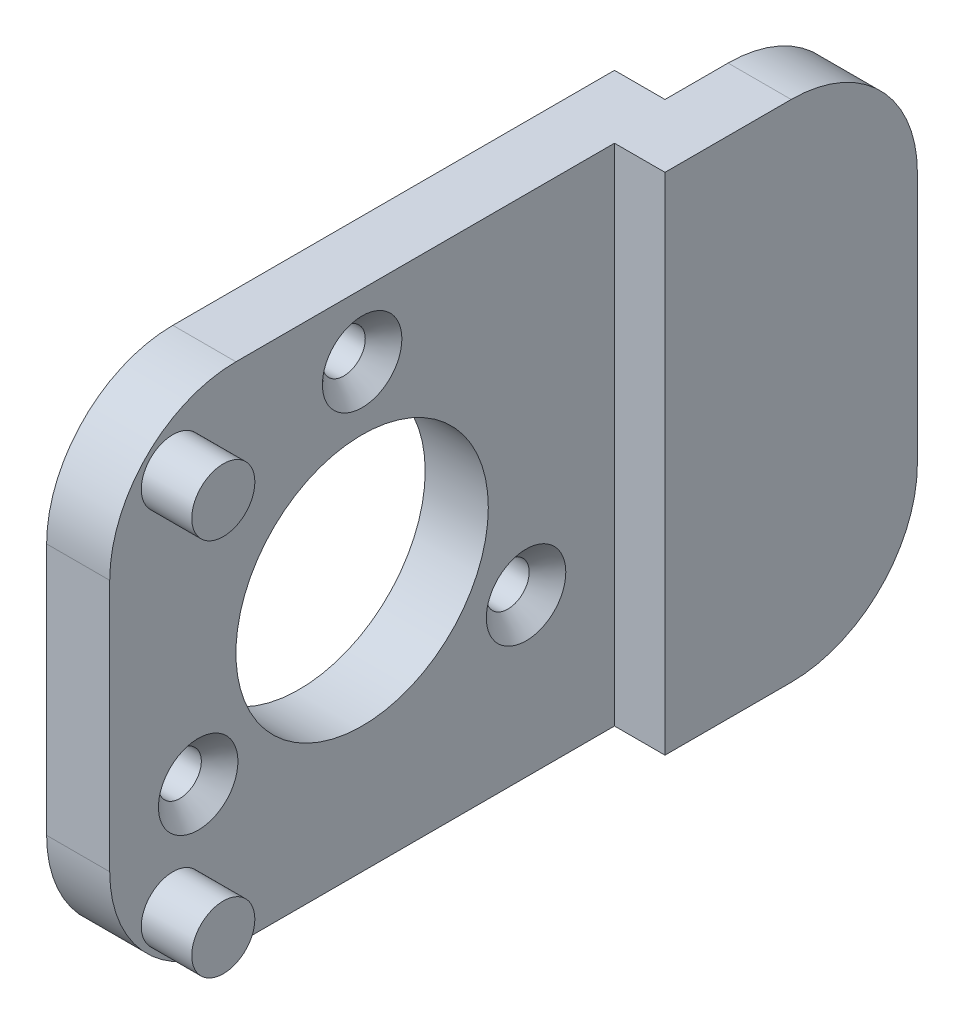
ISO-10303-21;
HEADER;
FILE_DESCRIPTION(('STEP AP214'),'2;1');
FILE_NAME('part.step','',(''),(''),'','','');
FILE_SCHEMA(('AUTOMOTIVE_DESIGN { 1 0 10303 214 1 1 1 1 }'));
ENDSEC;
DATA;
#1=APPLICATION_CONTEXT('core data for automotive mechanical design processes');
#2=APPLICATION_PROTOCOL_DEFINITION('international standard','automotive_design',2000,#1);
#3=PRODUCT_CONTEXT('',#1,'mechanical');
#4=PRODUCT('Part','Part','',(#3));
#5=PRODUCT_RELATED_PRODUCT_CATEGORY('part','',(#4));
#6=PRODUCT_DEFINITION_FORMATION('','',#4);
#7=PRODUCT_DEFINITION_CONTEXT('part definition',#1,'design');
#8=PRODUCT_DEFINITION('design','',#6,#7);
#9=PRODUCT_DEFINITION_SHAPE('','',#8);
#10=(LENGTH_UNIT() NAMED_UNIT(*) SI_UNIT(.MILLI.,.METRE.));
#11=(NAMED_UNIT(*) PLANE_ANGLE_UNIT() SI_UNIT($,.RADIAN.));
#12=(NAMED_UNIT(*) SI_UNIT($,.STERADIAN.) SOLID_ANGLE_UNIT());
#13=UNCERTAINTY_MEASURE_WITH_UNIT(LENGTH_MEASURE(1.E-05),#10,'distance_accuracy_value','');
#14=(GEOMETRIC_REPRESENTATION_CONTEXT(3) GLOBAL_UNCERTAINTY_ASSIGNED_CONTEXT((#13)) GLOBAL_UNIT_ASSIGNED_CONTEXT((#10,
#11,#12)) REPRESENTATION_CONTEXT('',''));
#15=CARTESIAN_POINT('',(0.,0.,0.));
#16=DIRECTION('',(0.,0.,1.));
#17=DIRECTION('',(1.,0.,0.));
#18=AXIS2_PLACEMENT_3D('',#15,#16,#17);
#19=CARTESIAN_POINT('',(5.,-10.,10.));
#20=DIRECTION('',(1.,0.,0.));
#21=DIRECTION('',(0.,0.,-1.));
#22=AXIS2_PLACEMENT_3D('',#19,#20,#21);
#23=PLANE('',#22);
#24=CARTESIAN_POINT('',(5.,-15.,15.));
#25=DIRECTION('',(1.,0.,0.));
#26=DIRECTION('',(0.,0.,-1.));
#27=AXIS2_PLACEMENT_3D('',#24,#25,#26);
#28=CIRCLE('',#27,2.5);
#29=CARTESIAN_POINT('',(5.,-15.,12.5));
#30=VERTEX_POINT('',#29);
#31=EDGE_CURVE('E146',#30,#30,#28,.T.);
#32=ORIENTED_EDGE('',*,*,#31,.F.);
#33=EDGE_LOOP('',(#32));
#34=FACE_BOUND('',#33,.T.);
#35=CARTESIAN_POINT('',(5.,15.,-1.02146070820057E-12));
#36=DIRECTION('',(1.,0.,0.));
#37=DIRECTION('',(0.,0.,-1.));
#38=AXIS2_PLACEMENT_3D('',#35,#36,#37);
#39=CIRCLE('',#38,3.15);
#40=CARTESIAN_POINT('',(5.,15.,-3.15000000000102));
#41=VERTEX_POINT('',#40);
#42=EDGE_CURVE('E173',#41,#41,#39,.T.);
#43=ORIENTED_EDGE('',*,*,#42,.F.);
#44=EDGE_LOOP('',(#43));
#45=FACE_BOUND('',#44,.T.);
#46=CARTESIAN_POINT('',(5.,-7.50000000000034,-12.990381056767));
#47=DIRECTION('',(1.,0.,0.));
#48=DIRECTION('',(0.,0.,-1.));
#49=AXIS2_PLACEMENT_3D('',#46,#47,#48);
#50=CIRCLE('',#49,3.15);
#51=CARTESIAN_POINT('',(5.,-7.50000000000034,-16.140381056767));
#52=VERTEX_POINT('',#51);
#53=EDGE_CURVE('E184',#52,#52,#50,.T.);
#54=ORIENTED_EDGE('',*,*,#53,.F.);
#55=EDGE_LOOP('',(#54));
#56=FACE_BOUND('',#55,.T.);
#57=CARTESIAN_POINT('',(5.,-7.49999999999966,12.9903810567661));
#58=DIRECTION('',(1.,0.,0.));
#59=DIRECTION('',(0.,0.,-1.));
#60=AXIS2_PLACEMENT_3D('',#57,#58,#59);
#61=CIRCLE('',#60,3.15);
#62=CARTESIAN_POINT('',(5.,-7.49999999999966,9.84038105676615));
#63=VERTEX_POINT('',#62);
#64=EDGE_CURVE('E193',#63,#63,#61,.T.);
#65=ORIENTED_EDGE('',*,*,#64,.F.);
#66=EDGE_LOOP('',(#65));
#67=FACE_BOUND('',#66,.T.);
#68=DIRECTION('',(0.,0.,-1.));
#69=VECTOR('',#68,1.);
#70=CARTESIAN_POINT('',(5.,-20.,-20.));
#71=LINE('',#70,#69);
#72=CARTESIAN_POINT('',(5.,-20.,9.99999999999993));
#73=VERTEX_POINT('',#72);
#74=CARTESIAN_POINT('',(5.,-20.,-20.));
#75=VERTEX_POINT('',#74);
#76=EDGE_CURVE('E219',#73,#75,#71,.T.);
#77=ORIENTED_EDGE('',*,*,#76,.T.);
#78=DIRECTION('',(0.,1.,0.));
#79=VECTOR('',#78,1.);
#80=CARTESIAN_POINT('',(5.,-9.99999999999993,-20.));
#81=LINE('',#80,#79);
#82=CARTESIAN_POINT('',(5.,20.,-20.));
#83=VERTEX_POINT('',#82);
#84=EDGE_CURVE('E214',#75,#83,#81,.T.);
#85=ORIENTED_EDGE('',*,*,#84,.T.);
#86=DIRECTION('',(0.,0.,1.));
#87=VECTOR('',#86,1.);
#88=CARTESIAN_POINT('',(5.,20.,-9.99999999999993));
#89=LINE('',#88,#87);
#90=CARTESIAN_POINT('',(5.,20.,9.99999999999993));
#91=VERTEX_POINT('',#90);
#92=EDGE_CURVE('E218',#83,#91,#89,.T.);
#93=ORIENTED_EDGE('',*,*,#92,.T.);
#94=CARTESIAN_POINT('',(5.,10.,10.));
#95=DIRECTION('',(1.,0.,0.));
#96=DIRECTION('',(0.,0.,-1.));
#97=AXIS2_PLACEMENT_3D('',#94,#95,#96);
#98=CIRCLE('',#97,10.);
#99=CARTESIAN_POINT('',(5.,9.99999999999993,20.));
#100=VERTEX_POINT('',#99);
#101=EDGE_CURVE('E211',#91,#100,#98,.T.);
#102=ORIENTED_EDGE('',*,*,#101,.T.);
#103=DIRECTION('',(0.,-1.,0.));
#104=VECTOR('',#103,1.);
#105=CARTESIAN_POINT('',(5.,9.99999999999993,20.));
#106=LINE('',#105,#104);
#107=CARTESIAN_POINT('',(5.,-9.99999999999993,20.));
#108=VERTEX_POINT('',#107);
#109=EDGE_CURVE('E290',#100,#108,#106,.T.);
#110=ORIENTED_EDGE('',*,*,#109,.T.);
#111=CARTESIAN_POINT('',(5.,-10.,10.));
#112=DIRECTION('',(1.,0.,0.));
#113=DIRECTION('',(0.,0.,-1.));
#114=AXIS2_PLACEMENT_3D('',#111,#112,#113);
#115=CIRCLE('',#114,10.);
#116=EDGE_CURVE('E245',#108,#73,#115,.T.);
#117=ORIENTED_EDGE('',*,*,#116,.T.);
#118=EDGE_LOOP('',(#77,#85,#93,#102,#110,#117));
#119=FACE_BOUND('',#118,.T.);
#120=CARTESIAN_POINT('',(5.,0.,0.));
#121=DIRECTION('',(1.,0.,0.));
#122=DIRECTION('',(0.,0.,-1.));
#123=AXIS2_PLACEMENT_3D('',#120,#121,#122);
#124=CIRCLE('',#123,10.);
#125=CARTESIAN_POINT('',(5.,0.,-10.));
#126=VERTEX_POINT('',#125);
#127=EDGE_CURVE('E203',#126,#126,#124,.T.);
#128=ORIENTED_EDGE('',*,*,#127,.F.);
#129=EDGE_LOOP('',(#128));
#130=FACE_BOUND('',#129,.T.);
#131=CARTESIAN_POINT('',(5.,15.,14.9999999999924));
#132=DIRECTION('',(1.,0.,0.));
#133=DIRECTION('',(0.,0.,-1.));
#134=AXIS2_PLACEMENT_3D('',#131,#132,#133);
#135=CIRCLE('',#134,2.5);
#136=CARTESIAN_POINT('',(5.,15.,12.4999999999924));
#137=VERTEX_POINT('',#136);
#138=EDGE_CURVE('E484',#137,#137,#135,.T.);
#139=ORIENTED_EDGE('',*,*,#138,.F.);
#140=EDGE_LOOP('',(#139));
#141=FACE_BOUND('',#140,.T.);
#142=ADVANCED_FACE('F32',(#34,#45,#56,#67,#119,#130,#141),#23,.T.);
#143=CARTESIAN_POINT('',(0.,-10.,10.));
#144=DIRECTION('',(1.,0.,0.));
#145=DIRECTION('',(0.,0.,-1.));
#146=AXIS2_PLACEMENT_3D('',#143,#144,#145);
#147=PLANE('',#146);
#148=CARTESIAN_POINT('',(0.,15.,-1.02146070820057E-12));
#149=DIRECTION('',(1.,0.,0.));
#150=DIRECTION('',(0.,0.,-1.));
#151=AXIS2_PLACEMENT_3D('',#148,#149,#150);
#152=CIRCLE('',#151,1.7);
#153=CARTESIAN_POINT('',(0.,15.,-1.70000000000102));
#154=VERTEX_POINT('',#153);
#155=EDGE_CURVE('E181',#154,#154,#152,.T.);
#156=ORIENTED_EDGE('',*,*,#155,.T.);
#157=EDGE_LOOP('',(#156));
#158=FACE_BOUND('',#157,.T.);
#159=CARTESIAN_POINT('',(0.,-7.50000000000034,-12.990381056767));
#160=DIRECTION('',(1.,0.,0.));
#161=DIRECTION('',(0.,0.,-1.));
#162=AXIS2_PLACEMENT_3D('',#159,#160,#161);
#163=CIRCLE('',#162,1.7);
#164=CARTESIAN_POINT('',(0.,-7.50000000000034,-14.690381056767));
#165=VERTEX_POINT('',#164);
#166=EDGE_CURVE('E190',#165,#165,#163,.T.);
#167=ORIENTED_EDGE('',*,*,#166,.T.);
#168=EDGE_LOOP('',(#167));
#169=FACE_BOUND('',#168,.T.);
#170=CARTESIAN_POINT('',(0.,-7.49999999999966,12.9903810567661));
#171=DIRECTION('',(1.,0.,0.));
#172=DIRECTION('',(0.,0.,-1.));
#173=AXIS2_PLACEMENT_3D('',#170,#171,#172);
#174=CIRCLE('',#173,1.7);
#175=CARTESIAN_POINT('',(0.,-7.49999999999966,11.2903810567661));
#176=VERTEX_POINT('',#175);
#177=EDGE_CURVE('E199',#176,#176,#174,.T.);
#178=ORIENTED_EDGE('',*,*,#177,.T.);
#179=EDGE_LOOP('',(#178));
#180=FACE_BOUND('',#179,.T.);
#181=DIRECTION('',(0.,0.,1.));
#182=VECTOR('',#181,1.);
#183=CARTESIAN_POINT('',(0.,20.,9.99999999999993));
#184=LINE('',#183,#182);
#185=CARTESIAN_POINT('',(0.,20.,-25.));
#186=VERTEX_POINT('',#185);
#187=CARTESIAN_POINT('',(0.,20.,9.99999999999993));
#188=VERTEX_POINT('',#187);
#189=EDGE_CURVE('E206',#186,#188,#184,.T.);
#190=ORIENTED_EDGE('',*,*,#189,.F.);
#191=DIRECTION('',(0.,-1.,0.));
#192=VECTOR('',#191,1.);
#193=CARTESIAN_POINT('',(0.,-20.,-25.));
#194=LINE('',#193,#192);
#195=CARTESIAN_POINT('',(0.,-20.,-25.));
#196=VERTEX_POINT('',#195);
#197=EDGE_CURVE('E135',#186,#196,#194,.T.);
#198=ORIENTED_EDGE('',*,*,#197,.T.);
#199=DIRECTION('',(0.,0.,-1.));
#200=VECTOR('',#199,1.);
#201=CARTESIAN_POINT('',(0.,-20.,9.99999999999993));
#202=LINE('',#201,#200);
#203=CARTESIAN_POINT('',(0.,-20.,9.99999999999993));
#204=VERTEX_POINT('',#203);
#205=EDGE_CURVE('E227',#204,#196,#202,.T.);
#206=ORIENTED_EDGE('',*,*,#205,.F.);
#207=CARTESIAN_POINT('',(0.,-10.,10.));
#208=DIRECTION('',(1.,0.,0.));
#209=DIRECTION('',(0.,0.,-1.));
#210=AXIS2_PLACEMENT_3D('',#207,#208,#209);
#211=CIRCLE('',#210,10.);
#212=CARTESIAN_POINT('',(0.,-9.99999999999993,20.));
#213=VERTEX_POINT('',#212);
#214=EDGE_CURVE('E233',#213,#204,#211,.T.);
#215=ORIENTED_EDGE('',*,*,#214,.F.);
#216=DIRECTION('',(0.,-1.,0.));
#217=VECTOR('',#216,1.);
#218=CARTESIAN_POINT('',(0.,9.99999999999993,20.));
#219=LINE('',#218,#217);
#220=CARTESIAN_POINT('',(0.,9.99999999999993,20.));
#221=VERTEX_POINT('',#220);
#222=EDGE_CURVE('E238',#221,#213,#219,.T.);
#223=ORIENTED_EDGE('',*,*,#222,.F.);
#224=CARTESIAN_POINT('',(0.,10.,10.));
#225=DIRECTION('',(1.,0.,0.));
#226=DIRECTION('',(0.,0.,-1.));
#227=AXIS2_PLACEMENT_3D('',#224,#225,#226);
#228=CIRCLE('',#227,10.);
#229=EDGE_CURVE('E295',#188,#221,#228,.T.);
#230=ORIENTED_EDGE('',*,*,#229,.F.);
#231=EDGE_LOOP('',(#190,#198,#206,#215,#223,#230));
#232=FACE_BOUND('',#231,.T.);
#233=CARTESIAN_POINT('',(0.,0.,0.));
#234=DIRECTION('',(1.,0.,0.));
#235=DIRECTION('',(0.,0.,-1.));
#236=AXIS2_PLACEMENT_3D('',#233,#234,#235);
#237=CIRCLE('',#236,10.);
#238=CARTESIAN_POINT('',(0.,0.,-10.));
#239=VERTEX_POINT('',#238);
#240=EDGE_CURVE('E202',#239,#239,#237,.T.);
#241=ORIENTED_EDGE('',*,*,#240,.T.);
#242=EDGE_LOOP('',(#241));
#243=FACE_BOUND('',#242,.T.);
#244=ADVANCED_FACE('F303',(#158,#169,#180,#232,#243),#147,.F.);
#245=CARTESIAN_POINT('',(5.,20.,9.99999999999993));
#246=DIRECTION('',(0.,-1.,0.));
#247=DIRECTION('',(0.,0.,-1.));
#248=AXIS2_PLACEMENT_3D('',#245,#246,#247);
#249=PLANE('',#248);
#250=DIRECTION('',(0.,0.,-1.));
#251=VECTOR('',#250,1.);
#252=CARTESIAN_POINT('',(9.,20.,-20.));
#253=LINE('',#252,#251);
#254=CARTESIAN_POINT('',(9.,20.,-20.));
#255=VERTEX_POINT('',#254);
#256=CARTESIAN_POINT('',(9.,20.,-30.));
#257=VERTEX_POINT('',#256);
#258=EDGE_CURVE('E160',#255,#257,#253,.T.);
#259=ORIENTED_EDGE('',*,*,#258,.T.);
#260=DIRECTION('',(1.,0.,0.));
#261=VECTOR('',#260,1.);
#262=CARTESIAN_POINT('',(5.,20.,-30.));
#263=LINE('',#262,#261);
#264=CARTESIAN_POINT('',(4.,20.,-30.));
#265=VERTEX_POINT('',#264);
#266=EDGE_CURVE('E55',#257,#265,#263,.F.);
#267=ORIENTED_EDGE('',*,*,#266,.T.);
#268=DIRECTION('',(0.,0.,1.));
#269=VECTOR('',#268,1.);
#270=CARTESIAN_POINT('',(4.,20.,-40.));
#271=LINE('',#270,#269);
#272=CARTESIAN_POINT('',(4.,20.,-25.));
#273=VERTEX_POINT('',#272);
#274=EDGE_CURVE('E118',#265,#273,#271,.T.);
#275=ORIENTED_EDGE('',*,*,#274,.T.);
#276=DIRECTION('',(-1.,0.,0.));
#277=VECTOR('',#276,1.);
#278=CARTESIAN_POINT('',(9.,20.,-25.));
#279=LINE('',#278,#277);
#280=EDGE_CURVE('E121',#273,#186,#279,.T.);
#281=ORIENTED_EDGE('',*,*,#280,.T.);
#282=ORIENTED_EDGE('',*,*,#189,.T.);
#283=DIRECTION('',(-1.,0.,0.));
#284=VECTOR('',#283,1.);
#285=CARTESIAN_POINT('',(5.,20.,9.99999999999993));
#286=LINE('',#285,#284);
#287=EDGE_CURVE('E220',#91,#188,#286,.T.);
#288=ORIENTED_EDGE('',*,*,#287,.F.);
#289=ORIENTED_EDGE('',*,*,#92,.F.);
#290=DIRECTION('',(-1.,0.,0.));
#291=VECTOR('',#290,1.);
#292=CARTESIAN_POINT('',(9.,20.,-20.));
#293=LINE('',#292,#291);
#294=EDGE_CURVE('E137',#255,#83,#293,.T.);
#295=ORIENTED_EDGE('',*,*,#294,.F.);
#296=EDGE_LOOP('',(#259,#267,#275,#281,#282,#288,#289,#295));
#297=FACE_BOUND('',#296,.T.);
#298=ADVANCED_FACE('F120',(#297),#249,.F.);
#299=CARTESIAN_POINT('',(5.,10.,10.));
#300=DIRECTION('',(-1.,0.,0.));
#301=DIRECTION('',(0.,0.,1.));
#302=AXIS2_PLACEMENT_3D('',#299,#300,#301);
#303=CYLINDRICAL_SURFACE('',#302,10.);
#304=ORIENTED_EDGE('',*,*,#229,.T.);
#305=DIRECTION('',(-1.,0.,0.));
#306=VECTOR('',#305,1.);
#307=CARTESIAN_POINT('',(5.,9.99999999999993,20.));
#308=LINE('',#307,#306);
#309=EDGE_CURVE('E247',#100,#221,#308,.T.);
#310=ORIENTED_EDGE('',*,*,#309,.F.);
#311=ORIENTED_EDGE('',*,*,#101,.F.);
#312=ORIENTED_EDGE('',*,*,#287,.T.);
#313=EDGE_LOOP('',(#304,#310,#311,#312));
#314=FACE_BOUND('',#313,.T.);
#315=ADVANCED_FACE('F289',(#314),#303,.T.);
#316=CARTESIAN_POINT('',(5.,9.99999999999993,20.));
#317=DIRECTION('',(0.,0.,-1.));
#318=DIRECTION('',(0.,1.,0.));
#319=AXIS2_PLACEMENT_3D('',#316,#317,#318);
#320=PLANE('',#319);
#321=ORIENTED_EDGE('',*,*,#222,.T.);
#322=DIRECTION('',(-1.,0.,0.));
#323=VECTOR('',#322,1.);
#324=CARTESIAN_POINT('',(5.,-9.99999999999993,20.));
#325=LINE('',#324,#323);
#326=EDGE_CURVE('E244',#108,#213,#325,.T.);
#327=ORIENTED_EDGE('',*,*,#326,.F.);
#328=ORIENTED_EDGE('',*,*,#109,.F.);
#329=ORIENTED_EDGE('',*,*,#309,.T.);
#330=EDGE_LOOP('',(#321,#327,#328,#329));
#331=FACE_BOUND('',#330,.T.);
#332=ADVANCED_FACE('F296',(#331),#320,.F.);
#333=CARTESIAN_POINT('',(5.,-10.,10.));
#334=DIRECTION('',(-1.,0.,0.));
#335=DIRECTION('',(0.,0.,1.));
#336=AXIS2_PLACEMENT_3D('',#333,#334,#335);
#337=CYLINDRICAL_SURFACE('',#336,10.);
#338=ORIENTED_EDGE('',*,*,#214,.T.);
#339=DIRECTION('',(-1.,0.,0.));
#340=VECTOR('',#339,1.);
#341=CARTESIAN_POINT('',(5.,-20.,9.99999999999993));
#342=LINE('',#341,#340);
#343=EDGE_CURVE('E242',#73,#204,#342,.T.);
#344=ORIENTED_EDGE('',*,*,#343,.F.);
#345=ORIENTED_EDGE('',*,*,#116,.F.);
#346=ORIENTED_EDGE('',*,*,#326,.T.);
#347=EDGE_LOOP('',(#338,#344,#345,#346));
#348=FACE_BOUND('',#347,.T.);
#349=ADVANCED_FACE('F301',(#348),#337,.T.);
#350=CARTESIAN_POINT('',(5.,-20.,9.99999999999993));
#351=DIRECTION('',(0.,1.,0.));
#352=DIRECTION('',(0.,0.,1.));
#353=AXIS2_PLACEMENT_3D('',#350,#351,#352);
#354=PLANE('',#353);
#355=DIRECTION('',(0.,0.,1.));
#356=VECTOR('',#355,1.);
#357=CARTESIAN_POINT('',(4.,-20.,-40.));
#358=LINE('',#357,#356);
#359=CARTESIAN_POINT('',(4.,-20.,-30.));
#360=VERTEX_POINT('',#359);
#361=CARTESIAN_POINT('',(4.,-20.,-25.));
#362=VERTEX_POINT('',#361);
#363=EDGE_CURVE('E125',#360,#362,#358,.T.);
#364=ORIENTED_EDGE('',*,*,#363,.F.);
#365=DIRECTION('',(-1.,0.,0.));
#366=VECTOR('',#365,1.);
#367=CARTESIAN_POINT('',(5.,-20.,-30.));
#368=LINE('',#367,#366);
#369=CARTESIAN_POINT('',(9.,-20.,-30.));
#370=VERTEX_POINT('',#369);
#371=EDGE_CURVE('E11',#360,#370,#368,.F.);
#372=ORIENTED_EDGE('',*,*,#371,.T.);
#373=DIRECTION('',(0.,0.,1.));
#374=VECTOR('',#373,1.);
#375=CARTESIAN_POINT('',(9.,-20.,-20.));
#376=LINE('',#375,#374);
#377=CARTESIAN_POINT('',(9.,-20.,-20.));
#378=VERTEX_POINT('',#377);
#379=EDGE_CURVE('E162',#370,#378,#376,.T.);
#380=ORIENTED_EDGE('',*,*,#379,.T.);
#381=DIRECTION('',(-1.,0.,0.));
#382=VECTOR('',#381,1.);
#383=CARTESIAN_POINT('',(9.,-20.,-20.));
#384=LINE('',#383,#382);
#385=EDGE_CURVE('E169',#378,#75,#384,.T.);
#386=ORIENTED_EDGE('',*,*,#385,.T.);
#387=ORIENTED_EDGE('',*,*,#76,.F.);
#388=ORIENTED_EDGE('',*,*,#343,.T.);
#389=ORIENTED_EDGE('',*,*,#205,.T.);
#390=DIRECTION('',(-1.,0.,0.));
#391=VECTOR('',#390,1.);
#392=CARTESIAN_POINT('',(9.,-20.,-25.));
#393=LINE('',#392,#391);
#394=EDGE_CURVE('E136',#362,#196,#393,.T.);
#395=ORIENTED_EDGE('',*,*,#394,.F.);
#396=EDGE_LOOP('',(#364,#372,#380,#386,#387,#388,#389,#395));
#397=FACE_BOUND('',#396,.T.);
#398=ADVANCED_FACE('F313',(#397),#354,.F.);
#399=CARTESIAN_POINT('',(5.,0.,0.));
#400=DIRECTION('',(-1.,0.,0.));
#401=DIRECTION('',(0.,0.,1.));
#402=AXIS2_PLACEMENT_3D('',#399,#400,#401);
#403=CYLINDRICAL_SURFACE('',#402,10.);
#404=ORIENTED_EDGE('',*,*,#127,.T.);
#405=EDGE_LOOP('',(#404));
#406=FACE_BOUND('',#405,.T.);
#407=ORIENTED_EDGE('',*,*,#240,.F.);
#408=EDGE_LOOP('',(#407));
#409=FACE_BOUND('',#408,.T.);
#410=ADVANCED_FACE('F310',(#406,#409),#403,.F.);
#411=CARTESIAN_POINT('',(5.,-7.49999999999966,12.9903810567661));
#412=DIRECTION('',(1.,0.,0.));
#413=DIRECTION('',(0.,0.,-1.));
#414=AXIS2_PLACEMENT_3D('',#411,#412,#413);
#415=CYLINDRICAL_SURFACE('',#414,1.7);
#416=ORIENTED_EDGE('',*,*,#177,.F.);
#417=EDGE_LOOP('',(#416));
#418=FACE_BOUND('',#417,.T.);
#419=CARTESIAN_POINT('',(3.55,-7.49999999999966,12.9903810567661));
#420=DIRECTION('',(1.,0.,0.));
#421=DIRECTION('',(0.,0.,-1.));
#422=AXIS2_PLACEMENT_3D('',#419,#420,#421);
#423=CIRCLE('',#422,1.7);
#424=CARTESIAN_POINT('',(3.55,-7.49999999999966,11.2903810567661));
#425=VERTEX_POINT('',#424);
#426=EDGE_CURVE('E196',#425,#425,#423,.T.);
#427=ORIENTED_EDGE('',*,*,#426,.T.);
#428=EDGE_LOOP('',(#427));
#429=FACE_BOUND('',#428,.T.);
#430=ADVANCED_FACE('F312',(#418,#429),#415,.F.);
#431=CARTESIAN_POINT('',(5.,-7.49999999999966,12.9903810567661));
#432=DIRECTION('',(1.,0.,0.));
#433=DIRECTION('',(0.,0.,-1.));
#434=AXIS2_PLACEMENT_3D('',#431,#432,#433);
#435=CONICAL_SURFACE('',#434,3.15,0.78539816339745);
#436=ORIENTED_EDGE('',*,*,#426,.F.);
#437=EDGE_LOOP('',(#436));
#438=FACE_BOUND('',#437,.T.);
#439=ORIENTED_EDGE('',*,*,#64,.T.);
#440=EDGE_LOOP('',(#439));
#441=FACE_BOUND('',#440,.T.);
#442=ADVANCED_FACE('F320',(#438,#441),#435,.F.);
#443=CARTESIAN_POINT('',(5.,-7.50000000000034,-12.990381056767));
#444=DIRECTION('',(1.,0.,0.));
#445=DIRECTION('',(0.,0.,-1.));
#446=AXIS2_PLACEMENT_3D('',#443,#444,#445);
#447=CYLINDRICAL_SURFACE('',#446,1.7);
#448=ORIENTED_EDGE('',*,*,#166,.F.);
#449=EDGE_LOOP('',(#448));
#450=FACE_BOUND('',#449,.T.);
#451=CARTESIAN_POINT('',(3.55,-7.50000000000034,-12.990381056767));
#452=DIRECTION('',(1.,0.,0.));
#453=DIRECTION('',(0.,0.,-1.));
#454=AXIS2_PLACEMENT_3D('',#451,#452,#453);
#455=CIRCLE('',#454,1.7);
#456=CARTESIAN_POINT('',(3.55,-7.50000000000034,-14.690381056767));
#457=VERTEX_POINT('',#456);
#458=EDGE_CURVE('E187',#457,#457,#455,.T.);
#459=ORIENTED_EDGE('',*,*,#458,.T.);
#460=EDGE_LOOP('',(#459));
#461=FACE_BOUND('',#460,.T.);
#462=ADVANCED_FACE('F371',(#450,#461),#447,.F.);
#463=CARTESIAN_POINT('',(5.,-7.50000000000034,-12.990381056767));
#464=DIRECTION('',(1.,0.,0.));
#465=DIRECTION('',(0.,0.,-1.));
#466=AXIS2_PLACEMENT_3D('',#463,#464,#465);
#467=CONICAL_SURFACE('',#466,3.15,0.78539816339745);
#468=ORIENTED_EDGE('',*,*,#458,.F.);
#469=EDGE_LOOP('',(#468));
#470=FACE_BOUND('',#469,.T.);
#471=ORIENTED_EDGE('',*,*,#53,.T.);
#472=EDGE_LOOP('',(#471));
#473=FACE_BOUND('',#472,.T.);
#474=ADVANCED_FACE('F367',(#470,#473),#467,.F.);
#475=CARTESIAN_POINT('',(5.,15.,-1.02146070820057E-12));
#476=DIRECTION('',(1.,0.,0.));
#477=DIRECTION('',(0.,0.,-1.));
#478=AXIS2_PLACEMENT_3D('',#475,#476,#477);
#479=CYLINDRICAL_SURFACE('',#478,1.7);
#480=ORIENTED_EDGE('',*,*,#155,.F.);
#481=EDGE_LOOP('',(#480));
#482=FACE_BOUND('',#481,.T.);
#483=CARTESIAN_POINT('',(3.55,15.,-1.02146070820057E-12));
#484=DIRECTION('',(1.,0.,0.));
#485=DIRECTION('',(0.,0.,-1.));
#486=AXIS2_PLACEMENT_3D('',#483,#484,#485);
#487=CIRCLE('',#486,1.7);
#488=CARTESIAN_POINT('',(3.55,15.,-1.70000000000102));
#489=VERTEX_POINT('',#488);
#490=EDGE_CURVE('E178',#489,#489,#487,.T.);
#491=ORIENTED_EDGE('',*,*,#490,.T.);
#492=EDGE_LOOP('',(#491));
#493=FACE_BOUND('',#492,.T.);
#494=ADVANCED_FACE('F363',(#482,#493),#479,.F.);
#495=CARTESIAN_POINT('',(5.,15.,-1.02146070820057E-12));
#496=DIRECTION('',(1.,0.,0.));
#497=DIRECTION('',(0.,0.,-1.));
#498=AXIS2_PLACEMENT_3D('',#495,#496,#497);
#499=CONICAL_SURFACE('',#498,3.15,0.78539816339745);
#500=ORIENTED_EDGE('',*,*,#490,.F.);
#501=EDGE_LOOP('',(#500));
#502=FACE_BOUND('',#501,.T.);
#503=ORIENTED_EDGE('',*,*,#42,.T.);
#504=EDGE_LOOP('',(#503));
#505=FACE_BOUND('',#504,.T.);
#506=ADVANCED_FACE('F360',(#502,#505),#499,.F.);
#507=CARTESIAN_POINT('',(9.,-20.,-20.));
#508=DIRECTION('',(0.,0.,1.));
#509=DIRECTION('',(1.,0.,0.));
#510=AXIS2_PLACEMENT_3D('',#507,#508,#509);
#511=PLANE('',#510);
#512=ORIENTED_EDGE('',*,*,#84,.F.);
#513=ORIENTED_EDGE('',*,*,#385,.F.);
#514=DIRECTION('',(0.,1.,0.));
#515=VECTOR('',#514,1.);
#516=CARTESIAN_POINT('',(9.,-20.,-20.));
#517=LINE('',#516,#515);
#518=EDGE_CURVE('E157',#378,#255,#517,.T.);
#519=ORIENTED_EDGE('',*,*,#518,.T.);
#520=ORIENTED_EDGE('',*,*,#294,.T.);
#521=EDGE_LOOP('',(#512,#513,#519,#520));
#522=FACE_BOUND('',#521,.T.);
#523=ADVANCED_FACE('F286',(#522),#511,.T.);
#524=CARTESIAN_POINT('',(9.,-20.,-25.));
#525=DIRECTION('',(0.,0.,-1.));
#526=DIRECTION('',(-1.,0.,0.));
#527=AXIS2_PLACEMENT_3D('',#524,#525,#526);
#528=PLANE('',#527);
#529=DIRECTION('',(0.,1.,0.));
#530=VECTOR('',#529,1.);
#531=CARTESIAN_POINT('',(4.,-20.,-25.));
#532=LINE('',#531,#530);
#533=EDGE_CURVE('E132',#362,#273,#532,.T.);
#534=ORIENTED_EDGE('',*,*,#533,.F.);
#535=ORIENTED_EDGE('',*,*,#394,.T.);
#536=ORIENTED_EDGE('',*,*,#197,.F.);
#537=ORIENTED_EDGE('',*,*,#280,.F.);
#538=EDGE_LOOP('',(#534,#535,#536,#537));
#539=FACE_BOUND('',#538,.T.);
#540=ADVANCED_FACE('F131',(#539),#528,.T.);
#541=CARTESIAN_POINT('',(9.,0.,0.));
#542=DIRECTION('',(-1.,0.,0.));
#543=DIRECTION('',(0.,0.,1.));
#544=AXIS2_PLACEMENT_3D('',#541,#542,#543);
#545=PLANE('',#544);
#546=DIRECTION('',(0.,-1.,0.));
#547=VECTOR('',#546,1.);
#548=CARTESIAN_POINT('',(9.,-20.,-40.));
#549=LINE('',#548,#547);
#550=CARTESIAN_POINT('',(9.,9.99999999999999,-40.));
#551=VERTEX_POINT('',#550);
#552=CARTESIAN_POINT('',(9.,-10.,-40.));
#553=VERTEX_POINT('',#552);
#554=EDGE_CURVE('E140',#551,#553,#549,.T.);
#555=ORIENTED_EDGE('',*,*,#554,.F.);
#556=CARTESIAN_POINT('',(9.,10.,-30.));
#557=DIRECTION('',(-1.,0.,0.));
#558=DIRECTION('',(0.,0.,1.));
#559=AXIS2_PLACEMENT_3D('',#556,#557,#558);
#560=CIRCLE('',#559,10.);
#561=EDGE_CURVE('E271',#551,#257,#560,.F.);
#562=ORIENTED_EDGE('',*,*,#561,.T.);
#563=ORIENTED_EDGE('',*,*,#258,.F.);
#564=ORIENTED_EDGE('',*,*,#518,.F.);
#565=ORIENTED_EDGE('',*,*,#379,.F.);
#566=CARTESIAN_POINT('',(9.,-10.,-30.));
#567=DIRECTION('',(-1.,0.,0.));
#568=DIRECTION('',(0.,0.,1.));
#569=AXIS2_PLACEMENT_3D('',#566,#567,#568);
#570=CIRCLE('',#569,10.);
#571=EDGE_CURVE('E266',#370,#553,#570,.F.);
#572=ORIENTED_EDGE('',*,*,#571,.T.);
#573=EDGE_LOOP('',(#555,#562,#563,#564,#565,#572));
#574=FACE_BOUND('',#573,.T.);
#575=ADVANCED_FACE('F282',(#574),#545,.F.);
#576=CARTESIAN_POINT('',(4.,-20.,-40.));
#577=DIRECTION('',(1.,0.,0.));
#578=DIRECTION('',(0.,0.,-1.));
#579=AXIS2_PLACEMENT_3D('',#576,#577,#578);
#580=PLANE('',#579);
#581=ORIENTED_EDGE('',*,*,#274,.F.);
#582=CARTESIAN_POINT('',(4.,10.,-30.));
#583=DIRECTION('',(1.,0.,0.));
#584=DIRECTION('',(0.,0.,-1.));
#585=AXIS2_PLACEMENT_3D('',#582,#583,#584);
#586=CIRCLE('',#585,10.);
#587=CARTESIAN_POINT('',(4.,9.99999999999999,-40.));
#588=VERTEX_POINT('',#587);
#589=EDGE_CURVE('E40',#265,#588,#586,.F.);
#590=ORIENTED_EDGE('',*,*,#589,.T.);
#591=DIRECTION('',(0.,1.,0.));
#592=VECTOR('',#591,1.);
#593=CARTESIAN_POINT('',(4.,-20.,-40.));
#594=LINE('',#593,#592);
#595=CARTESIAN_POINT('',(4.,-10.,-40.));
#596=VERTEX_POINT('',#595);
#597=EDGE_CURVE('E126',#596,#588,#594,.T.);
#598=ORIENTED_EDGE('',*,*,#597,.F.);
#599=CARTESIAN_POINT('',(4.,-10.,-30.));
#600=DIRECTION('',(1.,0.,0.));
#601=DIRECTION('',(0.,0.,-1.));
#602=AXIS2_PLACEMENT_3D('',#599,#600,#601);
#603=CIRCLE('',#602,10.);
#604=EDGE_CURVE('E47',#596,#360,#603,.F.);
#605=ORIENTED_EDGE('',*,*,#604,.T.);
#606=ORIENTED_EDGE('',*,*,#363,.T.);
#607=ORIENTED_EDGE('',*,*,#533,.T.);
#608=EDGE_LOOP('',(#581,#590,#598,#605,#606,#607));
#609=FACE_BOUND('',#608,.T.);
#610=ADVANCED_FACE('F139',(#609),#580,.F.);
#611=CARTESIAN_POINT('',(0.,0.,-40.));
#612=DIRECTION('',(0.,0.,1.));
#613=DIRECTION('',(1.,0.,0.));
#614=AXIS2_PLACEMENT_3D('',#611,#612,#613);
#615=PLANE('',#614);
#616=ORIENTED_EDGE('',*,*,#597,.T.);
#617=DIRECTION('',(1.,0.,0.));
#618=VECTOR('',#617,1.);
#619=CARTESIAN_POINT('',(0.,10.,-40.));
#620=LINE('',#619,#618);
#621=EDGE_CURVE('E260',#588,#551,#620,.T.);
#622=ORIENTED_EDGE('',*,*,#621,.T.);
#623=ORIENTED_EDGE('',*,*,#554,.T.);
#624=DIRECTION('',(-1.,0.,0.));
#625=VECTOR('',#624,1.);
#626=CARTESIAN_POINT('',(0.,-10.,-40.));
#627=LINE('',#626,#625);
#628=EDGE_CURVE('E254',#553,#596,#627,.T.);
#629=ORIENTED_EDGE('',*,*,#628,.T.);
#630=EDGE_LOOP('',(#616,#622,#623,#629));
#631=FACE_BOUND('',#630,.T.);
#632=ADVANCED_FACE('F277',(#631),#615,.F.);
#633=CARTESIAN_POINT('',(0.,10.,-30.));
#634=DIRECTION('',(1.,0.,0.));
#635=DIRECTION('',(0.,0.,-1.));
#636=AXIS2_PLACEMENT_3D('',#633,#634,#635);
#637=CYLINDRICAL_SURFACE('',#636,10.);
#638=ORIENTED_EDGE('',*,*,#589,.F.);
#639=ORIENTED_EDGE('',*,*,#266,.F.);
#640=ORIENTED_EDGE('',*,*,#561,.F.);
#641=ORIENTED_EDGE('',*,*,#621,.F.);
#642=EDGE_LOOP('',(#638,#639,#640,#641));
#643=FACE_BOUND('',#642,.T.);
#644=ADVANCED_FACE('F279',(#643),#637,.T.);
#645=CARTESIAN_POINT('',(0.,-10.,-30.));
#646=DIRECTION('',(-1.,0.,0.));
#647=DIRECTION('',(0.,0.,1.));
#648=AXIS2_PLACEMENT_3D('',#645,#646,#647);
#649=CYLINDRICAL_SURFACE('',#648,10.);
#650=ORIENTED_EDGE('',*,*,#571,.F.);
#651=ORIENTED_EDGE('',*,*,#371,.F.);
#652=ORIENTED_EDGE('',*,*,#604,.F.);
#653=ORIENTED_EDGE('',*,*,#628,.F.);
#654=EDGE_LOOP('',(#650,#651,#652,#653));
#655=FACE_BOUND('',#654,.T.);
#656=ADVANCED_FACE('F34',(#655),#649,.T.);
#657=CARTESIAN_POINT('',(9.,-15.,15.));
#658=DIRECTION('',(-1.,0.,0.));
#659=DIRECTION('',(0.,0.,1.));
#660=AXIS2_PLACEMENT_3D('',#657,#658,#659);
#661=CYLINDRICAL_SURFACE('',#660,2.5);
#662=CARTESIAN_POINT('',(9.,-15.,15.));
#663=DIRECTION('',(1.,0.,0.));
#664=DIRECTION('',(0.,0.,-1.));
#665=AXIS2_PLACEMENT_3D('',#662,#663,#664);
#666=CIRCLE('',#665,2.5);
#667=CARTESIAN_POINT('',(9.,-15.,12.5));
#668=VERTEX_POINT('',#667);
#669=EDGE_CURVE('E141',#668,#668,#666,.T.);
#670=ORIENTED_EDGE('',*,*,#669,.F.);
#671=EDGE_LOOP('',(#670));
#672=FACE_BOUND('',#671,.T.);
#673=ORIENTED_EDGE('',*,*,#31,.T.);
#674=EDGE_LOOP('',(#673));
#675=FACE_BOUND('',#674,.T.);
#676=ADVANCED_FACE('F344',(#672,#675),#661,.T.);
#677=CARTESIAN_POINT('',(9.,-15.,15.));
#678=DIRECTION('',(1.,0.,0.));
#679=DIRECTION('',(0.,0.,-1.));
#680=AXIS2_PLACEMENT_3D('',#677,#678,#679);
#681=PLANE('',#680);
#682=ORIENTED_EDGE('',*,*,#669,.T.);
#683=EDGE_LOOP('',(#682));
#684=FACE_BOUND('',#683,.T.);
#685=ADVANCED_FACE('F449',(#684),#681,.T.);
#686=CARTESIAN_POINT('',(9.,15.,14.9999999999924));
#687=DIRECTION('',(-1.,0.,0.));
#688=DIRECTION('',(0.,0.,1.));
#689=AXIS2_PLACEMENT_3D('',#686,#687,#688);
#690=CYLINDRICAL_SURFACE('',#689,2.5);
#691=CARTESIAN_POINT('',(9.,15.,14.9999999999924));
#692=DIRECTION('',(1.,0.,0.));
#693=DIRECTION('',(0.,0.,-1.));
#694=AXIS2_PLACEMENT_3D('',#691,#692,#693);
#695=CIRCLE('',#694,2.5);
#696=CARTESIAN_POINT('',(9.,15.,12.4999999999924));
#697=VERTEX_POINT('',#696);
#698=EDGE_CURVE('E483',#697,#697,#695,.T.);
#699=ORIENTED_EDGE('',*,*,#698,.F.);
#700=EDGE_LOOP('',(#699));
#701=FACE_BOUND('',#700,.T.);
#702=ORIENTED_EDGE('',*,*,#138,.T.);
#703=EDGE_LOOP('',(#702));
#704=FACE_BOUND('',#703,.T.);
#705=ADVANCED_FACE('F458',(#701,#704),#690,.T.);
#706=CARTESIAN_POINT('',(9.,15.,14.9999999999924));
#707=DIRECTION('',(1.,0.,0.));
#708=DIRECTION('',(0.,0.,-1.));
#709=AXIS2_PLACEMENT_3D('',#706,#707,#708);
#710=PLANE('',#709);
#711=ORIENTED_EDGE('',*,*,#698,.T.);
#712=EDGE_LOOP('',(#711));
#713=FACE_BOUND('',#712,.T.);
#714=ADVANCED_FACE('F467',(#713),#710,.T.);
#715=CLOSED_SHELL('',(#142,#244,#298,#315,#332,#349,#398,#410,#430,#442,#462,#474,#494,#506,
#523,#540,#575,#610,#632,#644,#656,#676,#685,#705,#714));
#716=MANIFOLD_SOLID_BREP('B2',#715);
#717=ADVANCED_BREP_SHAPE_REPRESENTATION('',(#18,#716),#14);
#718=SHAPE_DEFINITION_REPRESENTATION(#9,#717);
ENDSEC;
END-ISO-10303-21;
